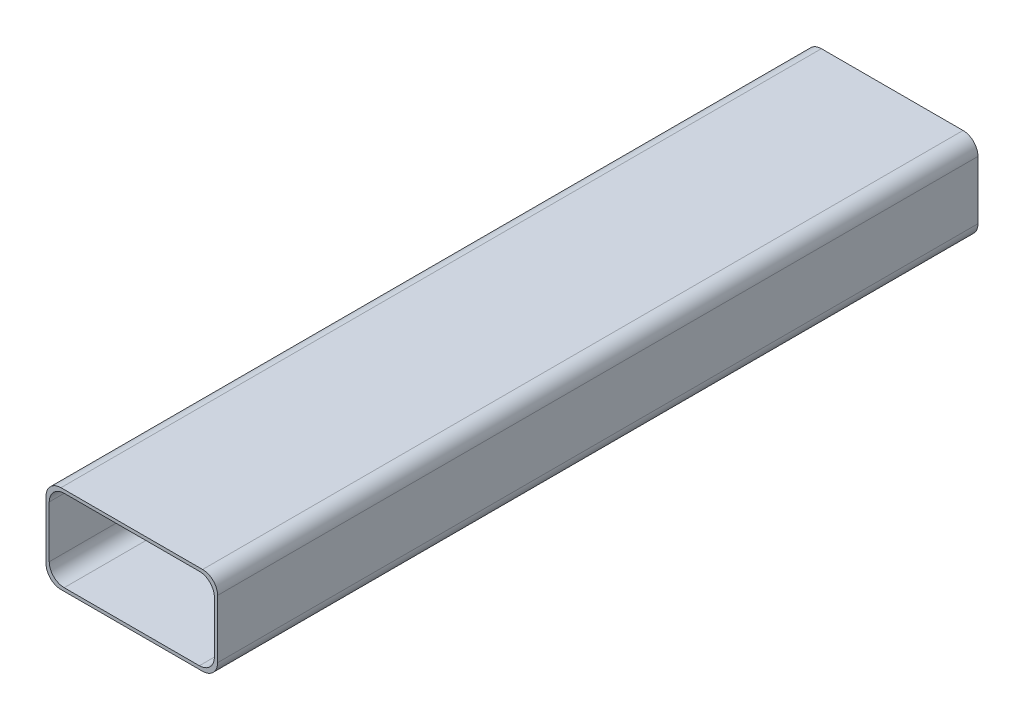
ISO-10303-21;
HEADER;
FILE_DESCRIPTION(('STEP AP214'),'2;1');
FILE_NAME('part.step','',(''),(''),'','','');
FILE_SCHEMA(('AUTOMOTIVE_DESIGN { 1 0 10303 214 1 1 1 1 }'));
ENDSEC;
DATA;
#1=APPLICATION_CONTEXT('core data for automotive mechanical design processes');
#2=APPLICATION_PROTOCOL_DEFINITION('international standard','automotive_design',2000,#1);
#3=PRODUCT_CONTEXT('',#1,'mechanical');
#4=PRODUCT('Part','Part','',(#3));
#5=PRODUCT_RELATED_PRODUCT_CATEGORY('part','',(#4));
#6=PRODUCT_DEFINITION_FORMATION('','',#4);
#7=PRODUCT_DEFINITION_CONTEXT('part definition',#1,'design');
#8=PRODUCT_DEFINITION('design','',#6,#7);
#9=PRODUCT_DEFINITION_SHAPE('','',#8);
#10=(LENGTH_UNIT() NAMED_UNIT(*) SI_UNIT(.MILLI.,.METRE.));
#11=(NAMED_UNIT(*) PLANE_ANGLE_UNIT() SI_UNIT($,.RADIAN.));
#12=(NAMED_UNIT(*) SI_UNIT($,.STERADIAN.) SOLID_ANGLE_UNIT());
#13=UNCERTAINTY_MEASURE_WITH_UNIT(LENGTH_MEASURE(1.E-05),#10,'distance_accuracy_value','');
#14=(GEOMETRIC_REPRESENTATION_CONTEXT(3) GLOBAL_UNCERTAINTY_ASSIGNED_CONTEXT((#13)) GLOBAL_UNIT_ASSIGNED_CONTEXT((#10,
#11,#12)) REPRESENTATION_CONTEXT('',''));
#15=CARTESIAN_POINT('',(0.,0.,0.));
#16=DIRECTION('',(0.,0.,1.));
#17=DIRECTION('',(1.,0.,0.));
#18=AXIS2_PLACEMENT_3D('',#15,#16,#17);
#19=CARTESIAN_POINT('',(47.3151,-19.464,508.));
#20=DIRECTION('',(0.,0.,1.));
#21=DIRECTION('',(1.,0.,0.));
#22=AXIS2_PLACEMENT_3D('',#19,#20,#21);
#23=PLANE('',#22);
#24=CARTESIAN_POINT('',(47.3151,-19.464,508.));
#25=DIRECTION('',(0.,0.,1.));
#26=DIRECTION('',(1.,0.,0.));
#27=AXIS2_PLACEMENT_3D('',#24,#25,#26);
#28=CIRCLE('',#27,10.);
#29=CARTESIAN_POINT('',(47.3150999999999,-29.464,508.));
#30=VERTEX_POINT('',#29);
#31=CARTESIAN_POINT('',(57.3151,-19.4639999999999,508.));
#32=VERTEX_POINT('',#31);
#33=EDGE_CURVE('E211',#30,#32,#28,.T.);
#34=ORIENTED_EDGE('',*,*,#33,.T.);
#35=DIRECTION('',(0.,1.,0.));
#36=VECTOR('',#35,1.);
#37=CARTESIAN_POINT('',(57.3151,-19.4639999999999,508.));
#38=LINE('',#37,#36);
#39=CARTESIAN_POINT('',(57.3151,19.4639999999999,508.));
#40=VERTEX_POINT('',#39);
#41=EDGE_CURVE('E214',#32,#40,#38,.T.);
#42=ORIENTED_EDGE('',*,*,#41,.T.);
#43=CARTESIAN_POINT('',(47.3151,19.464,508.));
#44=DIRECTION('',(0.,0.,1.));
#45=DIRECTION('',(-1.,0.,0.));
#46=AXIS2_PLACEMENT_3D('',#43,#44,#45);
#47=CIRCLE('',#46,10.);
#48=CARTESIAN_POINT('',(47.3150999999999,29.464,508.));
#49=VERTEX_POINT('',#48);
#50=EDGE_CURVE('E217',#40,#49,#47,.T.);
#51=ORIENTED_EDGE('',*,*,#50,.T.);
#52=DIRECTION('',(-1.,0.,0.));
#53=VECTOR('',#52,1.);
#54=CARTESIAN_POINT('',(-47.3150999999999,29.464,508.));
#55=LINE('',#54,#53);
#56=CARTESIAN_POINT('',(-47.3150999999999,29.464,508.));
#57=VERTEX_POINT('',#56);
#58=EDGE_CURVE('E219',#49,#57,#55,.T.);
#59=ORIENTED_EDGE('',*,*,#58,.T.);
#60=CARTESIAN_POINT('',(-47.3151,19.464,508.));
#61=DIRECTION('',(0.,0.,1.));
#62=DIRECTION('',(-1.,0.,0.));
#63=AXIS2_PLACEMENT_3D('',#60,#61,#62);
#64=CIRCLE('',#63,10.);
#65=CARTESIAN_POINT('',(-57.3151,19.4639999999999,508.));
#66=VERTEX_POINT('',#65);
#67=EDGE_CURVE('E221',#57,#66,#64,.T.);
#68=ORIENTED_EDGE('',*,*,#67,.T.);
#69=DIRECTION('',(0.,-1.,0.));
#70=VECTOR('',#69,1.);
#71=CARTESIAN_POINT('',(-57.3151,-19.4639999999999,508.));
#72=LINE('',#71,#70);
#73=CARTESIAN_POINT('',(-57.3151,-19.464,508.));
#74=VERTEX_POINT('',#73);
#75=EDGE_CURVE('E223',#66,#74,#72,.T.);
#76=ORIENTED_EDGE('',*,*,#75,.T.);
#77=CARTESIAN_POINT('',(-47.3151,-19.464,508.));
#78=DIRECTION('',(0.,0.,1.));
#79=DIRECTION('',(-1.,0.,0.));
#80=AXIS2_PLACEMENT_3D('',#77,#78,#79);
#81=CIRCLE('',#80,10.);
#82=CARTESIAN_POINT('',(-47.3150999999999,-29.464,508.));
#83=VERTEX_POINT('',#82);
#84=EDGE_CURVE('E225',#74,#83,#81,.T.);
#85=ORIENTED_EDGE('',*,*,#84,.T.);
#86=DIRECTION('',(1.,0.,0.));
#87=VECTOR('',#86,1.);
#88=CARTESIAN_POINT('',(-47.3150999999999,-29.464,508.));
#89=LINE('',#88,#87);
#90=EDGE_CURVE('E227',#83,#30,#89,.T.);
#91=ORIENTED_EDGE('',*,*,#90,.T.);
#92=EDGE_LOOP('',(#34,#42,#51,#59,#68,#76,#85,#91));
#93=FACE_BOUND('',#92,.T.);
#94=DIRECTION('',(0.,1.,0.));
#95=VECTOR('',#94,1.);
#96=CARTESIAN_POINT('',(55.1561,-17.3049999999999,508.));
#97=LINE('',#96,#95);
#98=CARTESIAN_POINT('',(55.1561,-17.3049999999999,508.));
#99=VERTEX_POINT('',#98);
#100=CARTESIAN_POINT('',(55.1561,17.3049999999999,508.));
#101=VERTEX_POINT('',#100);
#102=EDGE_CURVE('E154',#99,#101,#97,.T.);
#103=ORIENTED_EDGE('',*,*,#102,.F.);
#104=CARTESIAN_POINT('',(45.1561,-17.305,508.));
#105=DIRECTION('',(0.,0.,1.));
#106=DIRECTION('',(1.,0.,0.));
#107=AXIS2_PLACEMENT_3D('',#104,#105,#106);
#108=CIRCLE('',#107,10.);
#109=CARTESIAN_POINT('',(45.1560999999999,-27.305,508.));
#110=VERTEX_POINT('',#109);
#111=EDGE_CURVE('E146',#110,#99,#108,.T.);
#112=ORIENTED_EDGE('',*,*,#111,.F.);
#113=DIRECTION('',(1.,0.,0.));
#114=VECTOR('',#113,1.);
#115=CARTESIAN_POINT('',(-45.1560999999999,-27.305,508.));
#116=LINE('',#115,#114);
#117=CARTESIAN_POINT('',(-45.1560999999999,-27.305,508.));
#118=VERTEX_POINT('',#117);
#119=EDGE_CURVE('E179',#118,#110,#116,.T.);
#120=ORIENTED_EDGE('',*,*,#119,.F.);
#121=CARTESIAN_POINT('',(-45.1561,-17.305,508.));
#122=DIRECTION('',(0.,0.,1.));
#123=DIRECTION('',(-1.,0.,0.));
#124=AXIS2_PLACEMENT_3D('',#121,#122,#123);
#125=CIRCLE('',#124,10.);
#126=CARTESIAN_POINT('',(-55.1561,-17.305,508.));
#127=VERTEX_POINT('',#126);
#128=EDGE_CURVE('E177',#127,#118,#125,.T.);
#129=ORIENTED_EDGE('',*,*,#128,.F.);
#130=DIRECTION('',(0.,-1.,0.));
#131=VECTOR('',#130,1.);
#132=CARTESIAN_POINT('',(-55.1561,-17.3049999999999,508.));
#133=LINE('',#132,#131);
#134=CARTESIAN_POINT('',(-55.1561,17.3049999999999,508.));
#135=VERTEX_POINT('',#134);
#136=EDGE_CURVE('E175',#135,#127,#133,.T.);
#137=ORIENTED_EDGE('',*,*,#136,.F.);
#138=CARTESIAN_POINT('',(-45.1561,17.305,508.));
#139=DIRECTION('',(0.,0.,1.));
#140=DIRECTION('',(-1.,0.,0.));
#141=AXIS2_PLACEMENT_3D('',#138,#139,#140);
#142=CIRCLE('',#141,10.);
#143=CARTESIAN_POINT('',(-45.1560999999999,27.305,508.));
#144=VERTEX_POINT('',#143);
#145=EDGE_CURVE('E173',#144,#135,#142,.T.);
#146=ORIENTED_EDGE('',*,*,#145,.F.);
#147=DIRECTION('',(-1.,0.,0.));
#148=VECTOR('',#147,1.);
#149=CARTESIAN_POINT('',(-45.1560999999999,27.305,508.));
#150=LINE('',#149,#148);
#151=CARTESIAN_POINT('',(45.1560999999999,27.305,508.));
#152=VERTEX_POINT('',#151);
#153=EDGE_CURVE('E169',#152,#144,#150,.T.);
#154=ORIENTED_EDGE('',*,*,#153,.F.);
#155=CARTESIAN_POINT('',(45.1561,17.305,508.));
#156=DIRECTION('',(0.,0.,1.));
#157=DIRECTION('',(-1.,0.,0.));
#158=AXIS2_PLACEMENT_3D('',#155,#156,#157);
#159=CIRCLE('',#158,10.);
#160=EDGE_CURVE('E167',#101,#152,#159,.T.);
#161=ORIENTED_EDGE('',*,*,#160,.F.);
#162=EDGE_LOOP('',(#103,#112,#120,#129,#137,#146,#154,#161));
#163=FACE_BOUND('',#162,.T.);
#164=ADVANCED_FACE('F33',(#93,#163),#23,.T.);
#165=CARTESIAN_POINT('',(47.3151,-19.464,0.));
#166=DIRECTION('',(0.,0.,1.));
#167=DIRECTION('',(1.,0.,0.));
#168=AXIS2_PLACEMENT_3D('',#165,#166,#167);
#169=PLANE('',#168);
#170=CARTESIAN_POINT('',(47.3151,-19.464,0.));
#171=DIRECTION('',(0.,0.,1.));
#172=DIRECTION('',(1.,0.,0.));
#173=AXIS2_PLACEMENT_3D('',#170,#171,#172);
#174=CIRCLE('',#173,10.);
#175=CARTESIAN_POINT('',(47.3150999999999,-29.464,0.));
#176=VERTEX_POINT('',#175);
#177=CARTESIAN_POINT('',(57.3151,-19.4639999999999,0.));
#178=VERTEX_POINT('',#177);
#179=EDGE_CURVE('E162',#176,#178,#174,.T.);
#180=ORIENTED_EDGE('',*,*,#179,.F.);
#181=DIRECTION('',(1.,0.,0.));
#182=VECTOR('',#181,1.);
#183=CARTESIAN_POINT('',(-47.3150999999999,-29.464,0.));
#184=LINE('',#183,#182);
#185=CARTESIAN_POINT('',(-47.3150999999999,-29.464,0.));
#186=VERTEX_POINT('',#185);
#187=EDGE_CURVE('E215',#186,#176,#184,.T.);
#188=ORIENTED_EDGE('',*,*,#187,.F.);
#189=CARTESIAN_POINT('',(-47.3151,-19.464,0.));
#190=DIRECTION('',(0.,0.,1.));
#191=DIRECTION('',(-1.,0.,0.));
#192=AXIS2_PLACEMENT_3D('',#189,#190,#191);
#193=CIRCLE('',#192,10.);
#194=CARTESIAN_POINT('',(-57.3151,-19.464,0.));
#195=VERTEX_POINT('',#194);
#196=EDGE_CURVE('E242',#195,#186,#193,.T.);
#197=ORIENTED_EDGE('',*,*,#196,.F.);
#198=DIRECTION('',(0.,-1.,0.));
#199=VECTOR('',#198,1.);
#200=CARTESIAN_POINT('',(-57.3151,-19.4639999999999,0.));
#201=LINE('',#200,#199);
#202=CARTESIAN_POINT('',(-57.3151,19.4639999999999,0.));
#203=VERTEX_POINT('',#202);
#204=EDGE_CURVE('E240',#203,#195,#201,.T.);
#205=ORIENTED_EDGE('',*,*,#204,.F.);
#206=CARTESIAN_POINT('',(-47.3151,19.464,0.));
#207=DIRECTION('',(0.,0.,1.));
#208=DIRECTION('',(-1.,0.,0.));
#209=AXIS2_PLACEMENT_3D('',#206,#207,#208);
#210=CIRCLE('',#209,10.);
#211=CARTESIAN_POINT('',(-47.3150999999999,29.464,0.));
#212=VERTEX_POINT('',#211);
#213=EDGE_CURVE('E238',#212,#203,#210,.T.);
#214=ORIENTED_EDGE('',*,*,#213,.F.);
#215=DIRECTION('',(-1.,0.,0.));
#216=VECTOR('',#215,1.);
#217=CARTESIAN_POINT('',(-47.3150999999999,29.464,0.));
#218=LINE('',#217,#216);
#219=CARTESIAN_POINT('',(47.3150999999999,29.464,0.));
#220=VERTEX_POINT('',#219);
#221=EDGE_CURVE('E236',#220,#212,#218,.T.);
#222=ORIENTED_EDGE('',*,*,#221,.F.);
#223=CARTESIAN_POINT('',(47.3151,19.464,0.));
#224=DIRECTION('',(0.,0.,1.));
#225=DIRECTION('',(-1.,0.,0.));
#226=AXIS2_PLACEMENT_3D('',#223,#224,#225);
#227=CIRCLE('',#226,10.);
#228=CARTESIAN_POINT('',(57.3151,19.4639999999999,0.));
#229=VERTEX_POINT('',#228);
#230=EDGE_CURVE('E234',#229,#220,#227,.T.);
#231=ORIENTED_EDGE('',*,*,#230,.F.);
#232=DIRECTION('',(0.,1.,0.));
#233=VECTOR('',#232,1.);
#234=CARTESIAN_POINT('',(57.3151,-19.4639999999999,0.));
#235=LINE('',#234,#233);
#236=EDGE_CURVE('E232',#178,#229,#235,.T.);
#237=ORIENTED_EDGE('',*,*,#236,.F.);
#238=EDGE_LOOP('',(#180,#188,#197,#205,#214,#222,#231,#237));
#239=FACE_BOUND('',#238,.T.);
#240=CARTESIAN_POINT('',(45.1561,-17.305,0.));
#241=DIRECTION('',(0.,0.,1.));
#242=DIRECTION('',(1.,0.,0.));
#243=AXIS2_PLACEMENT_3D('',#240,#241,#242);
#244=CIRCLE('',#243,10.);
#245=CARTESIAN_POINT('',(45.1560999999999,-27.305,0.));
#246=VERTEX_POINT('',#245);
#247=CARTESIAN_POINT('',(55.1561,-17.3049999999999,0.));
#248=VERTEX_POINT('',#247);
#249=EDGE_CURVE('E56',#246,#248,#244,.T.);
#250=ORIENTED_EDGE('',*,*,#249,.T.);
#251=DIRECTION('',(0.,1.,0.));
#252=VECTOR('',#251,1.);
#253=CARTESIAN_POINT('',(55.1561,-17.3049999999999,0.));
#254=LINE('',#253,#252);
#255=CARTESIAN_POINT('',(55.1561,17.3049999999999,0.));
#256=VERTEX_POINT('',#255);
#257=EDGE_CURVE('E161',#248,#256,#254,.T.);
#258=ORIENTED_EDGE('',*,*,#257,.T.);
#259=CARTESIAN_POINT('',(45.1561,17.305,0.));
#260=DIRECTION('',(0.,0.,1.));
#261=DIRECTION('',(-1.,0.,0.));
#262=AXIS2_PLACEMENT_3D('',#259,#260,#261);
#263=CIRCLE('',#262,10.);
#264=CARTESIAN_POINT('',(45.1560999999999,27.305,0.));
#265=VERTEX_POINT('',#264);
#266=EDGE_CURVE('E183',#256,#265,#263,.T.);
#267=ORIENTED_EDGE('',*,*,#266,.T.);
#268=DIRECTION('',(-1.,0.,0.));
#269=VECTOR('',#268,1.);
#270=CARTESIAN_POINT('',(-45.1560999999999,27.305,0.));
#271=LINE('',#270,#269);
#272=CARTESIAN_POINT('',(-45.1560999999999,27.305,0.));
#273=VERTEX_POINT('',#272);
#274=EDGE_CURVE('E186',#265,#273,#271,.T.);
#275=ORIENTED_EDGE('',*,*,#274,.T.);
#276=CARTESIAN_POINT('',(-45.1561,17.305,0.));
#277=DIRECTION('',(0.,0.,1.));
#278=DIRECTION('',(-1.,0.,0.));
#279=AXIS2_PLACEMENT_3D('',#276,#277,#278);
#280=CIRCLE('',#279,10.);
#281=CARTESIAN_POINT('',(-55.1561,17.3049999999999,0.));
#282=VERTEX_POINT('',#281);
#283=EDGE_CURVE('E189',#273,#282,#280,.T.);
#284=ORIENTED_EDGE('',*,*,#283,.T.);
#285=DIRECTION('',(0.,-1.,0.));
#286=VECTOR('',#285,1.);
#287=CARTESIAN_POINT('',(-55.1561,-17.3049999999999,0.));
#288=LINE('',#287,#286);
#289=CARTESIAN_POINT('',(-55.1561,-17.305,0.));
#290=VERTEX_POINT('',#289);
#291=EDGE_CURVE('E192',#282,#290,#288,.T.);
#292=ORIENTED_EDGE('',*,*,#291,.T.);
#293=CARTESIAN_POINT('',(-45.1561,-17.305,0.));
#294=DIRECTION('',(0.,0.,1.));
#295=DIRECTION('',(-1.,0.,0.));
#296=AXIS2_PLACEMENT_3D('',#293,#294,#295);
#297=CIRCLE('',#296,10.);
#298=CARTESIAN_POINT('',(-45.1560999999999,-27.305,0.));
#299=VERTEX_POINT('',#298);
#300=EDGE_CURVE('E195',#290,#299,#297,.T.);
#301=ORIENTED_EDGE('',*,*,#300,.T.);
#302=DIRECTION('',(1.,0.,0.));
#303=VECTOR('',#302,1.);
#304=CARTESIAN_POINT('',(-45.1560999999999,-27.305,0.));
#305=LINE('',#304,#303);
#306=EDGE_CURVE('E155',#299,#246,#305,.T.);
#307=ORIENTED_EDGE('',*,*,#306,.T.);
#308=EDGE_LOOP('',(#250,#258,#267,#275,#284,#292,#301,#307));
#309=FACE_BOUND('',#308,.T.);
#310=ADVANCED_FACE('F272',(#239,#309),#169,.F.);
#311=CARTESIAN_POINT('',(47.3151,-19.464,508.));
#312=DIRECTION('',(0.,0.,-1.));
#313=DIRECTION('',(-1.,0.,0.));
#314=AXIS2_PLACEMENT_3D('',#311,#312,#313);
#315=CYLINDRICAL_SURFACE('',#314,10.);
#316=ORIENTED_EDGE('',*,*,#179,.T.);
#317=DIRECTION('',(0.,0.,-1.));
#318=VECTOR('',#317,1.);
#319=CARTESIAN_POINT('',(57.3151,-19.4639999999999,508.));
#320=LINE('',#319,#318);
#321=EDGE_CURVE('E11',#32,#178,#320,.T.);
#322=ORIENTED_EDGE('',*,*,#321,.F.);
#323=ORIENTED_EDGE('',*,*,#33,.F.);
#324=DIRECTION('',(0.,0.,-1.));
#325=VECTOR('',#324,1.);
#326=CARTESIAN_POINT('',(47.3150999999999,-29.464,508.));
#327=LINE('',#326,#325);
#328=EDGE_CURVE('E229',#30,#176,#327,.T.);
#329=ORIENTED_EDGE('',*,*,#328,.T.);
#330=EDGE_LOOP('',(#316,#322,#323,#329));
#331=FACE_BOUND('',#330,.T.);
#332=ADVANCED_FACE('F35',(#331),#315,.T.);
#333=CARTESIAN_POINT('',(57.3151,-19.4639999999999,508.));
#334=DIRECTION('',(-1.,0.,0.));
#335=DIRECTION('',(0.,0.,1.));
#336=AXIS2_PLACEMENT_3D('',#333,#334,#335);
#337=PLANE('',#336);
#338=ORIENTED_EDGE('',*,*,#236,.T.);
#339=DIRECTION('',(0.,0.,-1.));
#340=VECTOR('',#339,1.);
#341=CARTESIAN_POINT('',(57.3151,19.4639999999999,508.));
#342=LINE('',#341,#340);
#343=EDGE_CURVE('E41',#40,#229,#342,.T.);
#344=ORIENTED_EDGE('',*,*,#343,.F.);
#345=ORIENTED_EDGE('',*,*,#41,.F.);
#346=ORIENTED_EDGE('',*,*,#321,.T.);
#347=EDGE_LOOP('',(#338,#344,#345,#346));
#348=FACE_BOUND('',#347,.T.);
#349=ADVANCED_FACE('F289',(#348),#337,.F.);
#350=CARTESIAN_POINT('',(47.3151,19.464,508.));
#351=DIRECTION('',(0.,0.,-1.));
#352=DIRECTION('',(-1.,0.,0.));
#353=AXIS2_PLACEMENT_3D('',#350,#351,#352);
#354=CYLINDRICAL_SURFACE('',#353,10.);
#355=ORIENTED_EDGE('',*,*,#230,.T.);
#356=DIRECTION('',(0.,0.,-1.));
#357=VECTOR('',#356,1.);
#358=CARTESIAN_POINT('',(47.3150999999999,29.464,508.));
#359=LINE('',#358,#357);
#360=EDGE_CURVE('E259',#49,#220,#359,.T.);
#361=ORIENTED_EDGE('',*,*,#360,.F.);
#362=ORIENTED_EDGE('',*,*,#50,.F.);
#363=ORIENTED_EDGE('',*,*,#343,.T.);
#364=EDGE_LOOP('',(#355,#361,#362,#363));
#365=FACE_BOUND('',#364,.T.);
#366=ADVANCED_FACE('F266',(#365),#354,.T.);
#367=CARTESIAN_POINT('',(-47.3150999999999,29.464,508.));
#368=DIRECTION('',(0.,-1.,0.));
#369=DIRECTION('',(0.,0.,-1.));
#370=AXIS2_PLACEMENT_3D('',#367,#368,#369);
#371=PLANE('',#370);
#372=ORIENTED_EDGE('',*,*,#221,.T.);
#373=DIRECTION('',(0.,0.,-1.));
#374=VECTOR('',#373,1.);
#375=CARTESIAN_POINT('',(-47.3150999999999,29.464,508.));
#376=LINE('',#375,#374);
#377=EDGE_CURVE('E256',#57,#212,#376,.T.);
#378=ORIENTED_EDGE('',*,*,#377,.F.);
#379=ORIENTED_EDGE('',*,*,#58,.F.);
#380=ORIENTED_EDGE('',*,*,#360,.T.);
#381=EDGE_LOOP('',(#372,#378,#379,#380));
#382=FACE_BOUND('',#381,.T.);
#383=ADVANCED_FACE('F278',(#382),#371,.F.);
#384=CARTESIAN_POINT('',(-47.3151,19.464,508.));
#385=DIRECTION('',(0.,0.,-1.));
#386=DIRECTION('',(-1.,0.,0.));
#387=AXIS2_PLACEMENT_3D('',#384,#385,#386);
#388=CYLINDRICAL_SURFACE('',#387,10.);
#389=ORIENTED_EDGE('',*,*,#213,.T.);
#390=DIRECTION('',(0.,0.,-1.));
#391=VECTOR('',#390,1.);
#392=CARTESIAN_POINT('',(-57.3151,19.4639999999999,508.));
#393=LINE('',#392,#391);
#394=EDGE_CURVE('E253',#66,#203,#393,.T.);
#395=ORIENTED_EDGE('',*,*,#394,.F.);
#396=ORIENTED_EDGE('',*,*,#67,.F.);
#397=ORIENTED_EDGE('',*,*,#377,.T.);
#398=EDGE_LOOP('',(#389,#395,#396,#397));
#399=FACE_BOUND('',#398,.T.);
#400=ADVANCED_FACE('F282',(#399),#388,.T.);
#401=CARTESIAN_POINT('',(-57.3151,-19.4639999999999,508.));
#402=DIRECTION('',(1.,0.,0.));
#403=DIRECTION('',(0.,0.,-1.));
#404=AXIS2_PLACEMENT_3D('',#401,#402,#403);
#405=PLANE('',#404);
#406=ORIENTED_EDGE('',*,*,#204,.T.);
#407=DIRECTION('',(0.,0.,-1.));
#408=VECTOR('',#407,1.);
#409=CARTESIAN_POINT('',(-57.3151,-19.464,508.));
#410=LINE('',#409,#408);
#411=EDGE_CURVE('E250',#74,#195,#410,.T.);
#412=ORIENTED_EDGE('',*,*,#411,.F.);
#413=ORIENTED_EDGE('',*,*,#75,.F.);
#414=ORIENTED_EDGE('',*,*,#394,.T.);
#415=EDGE_LOOP('',(#406,#412,#413,#414));
#416=FACE_BOUND('',#415,.T.);
#417=ADVANCED_FACE('F302',(#416),#405,.F.);
#418=CARTESIAN_POINT('',(-47.3151,-19.464,508.));
#419=DIRECTION('',(0.,0.,-1.));
#420=DIRECTION('',(-1.,0.,0.));
#421=AXIS2_PLACEMENT_3D('',#418,#419,#420);
#422=CYLINDRICAL_SURFACE('',#421,10.);
#423=ORIENTED_EDGE('',*,*,#196,.T.);
#424=DIRECTION('',(0.,0.,-1.));
#425=VECTOR('',#424,1.);
#426=CARTESIAN_POINT('',(-47.3150999999999,-29.464,508.));
#427=LINE('',#426,#425);
#428=EDGE_CURVE('E247',#83,#186,#427,.T.);
#429=ORIENTED_EDGE('',*,*,#428,.F.);
#430=ORIENTED_EDGE('',*,*,#84,.F.);
#431=ORIENTED_EDGE('',*,*,#411,.T.);
#432=EDGE_LOOP('',(#423,#429,#430,#431));
#433=FACE_BOUND('',#432,.T.);
#434=ADVANCED_FACE('F300',(#433),#422,.T.);
#435=CARTESIAN_POINT('',(-47.3150999999999,-29.464,508.));
#436=DIRECTION('',(0.,1.,0.));
#437=DIRECTION('',(0.,0.,1.));
#438=AXIS2_PLACEMENT_3D('',#435,#436,#437);
#439=PLANE('',#438);
#440=ORIENTED_EDGE('',*,*,#187,.T.);
#441=ORIENTED_EDGE('',*,*,#328,.F.);
#442=ORIENTED_EDGE('',*,*,#90,.F.);
#443=ORIENTED_EDGE('',*,*,#428,.T.);
#444=EDGE_LOOP('',(#440,#441,#442,#443));
#445=FACE_BOUND('',#444,.T.);
#446=ADVANCED_FACE('F295',(#445),#439,.F.);
#447=CARTESIAN_POINT('',(45.1561,-17.305,508.));
#448=DIRECTION('',(0.,0.,-1.));
#449=DIRECTION('',(-1.,0.,0.));
#450=AXIS2_PLACEMENT_3D('',#447,#448,#449);
#451=CYLINDRICAL_SURFACE('',#450,10.);
#452=ORIENTED_EDGE('',*,*,#249,.F.);
#453=DIRECTION('',(0.,0.,-1.));
#454=VECTOR('',#453,1.);
#455=CARTESIAN_POINT('',(45.1560999999999,-27.305,508.));
#456=LINE('',#455,#454);
#457=EDGE_CURVE('E150',#110,#246,#456,.T.);
#458=ORIENTED_EDGE('',*,*,#457,.F.);
#459=ORIENTED_EDGE('',*,*,#111,.T.);
#460=DIRECTION('',(0.,0.,-1.));
#461=VECTOR('',#460,1.);
#462=CARTESIAN_POINT('',(55.1561,-17.3049999999999,508.));
#463=LINE('',#462,#461);
#464=EDGE_CURVE('E149',#99,#248,#463,.T.);
#465=ORIENTED_EDGE('',*,*,#464,.T.);
#466=EDGE_LOOP('',(#452,#458,#459,#465));
#467=FACE_BOUND('',#466,.T.);
#468=ADVANCED_FACE('F148',(#467),#451,.F.);
#469=CARTESIAN_POINT('',(55.1561,-17.3049999999999,508.));
#470=DIRECTION('',(-1.,0.,0.));
#471=DIRECTION('',(0.,0.,1.));
#472=AXIS2_PLACEMENT_3D('',#469,#470,#471);
#473=PLANE('',#472);
#474=ORIENTED_EDGE('',*,*,#257,.F.);
#475=ORIENTED_EDGE('',*,*,#464,.F.);
#476=ORIENTED_EDGE('',*,*,#102,.T.);
#477=DIRECTION('',(0.,0.,-1.));
#478=VECTOR('',#477,1.);
#479=CARTESIAN_POINT('',(55.1561,17.3049999999999,508.));
#480=LINE('',#479,#478);
#481=EDGE_CURVE('E163',#101,#256,#480,.T.);
#482=ORIENTED_EDGE('',*,*,#481,.T.);
#483=EDGE_LOOP('',(#474,#475,#476,#482));
#484=FACE_BOUND('',#483,.T.);
#485=ADVANCED_FACE('F158',(#484),#473,.T.);
#486=CARTESIAN_POINT('',(45.1561,17.305,508.));
#487=DIRECTION('',(0.,0.,-1.));
#488=DIRECTION('',(-1.,0.,0.));
#489=AXIS2_PLACEMENT_3D('',#486,#487,#488);
#490=CYLINDRICAL_SURFACE('',#489,10.);
#491=ORIENTED_EDGE('',*,*,#266,.F.);
#492=ORIENTED_EDGE('',*,*,#481,.F.);
#493=ORIENTED_EDGE('',*,*,#160,.T.);
#494=DIRECTION('',(0.,0.,-1.));
#495=VECTOR('',#494,1.);
#496=CARTESIAN_POINT('',(45.1560999999999,27.305,508.));
#497=LINE('',#496,#495);
#498=EDGE_CURVE('E208',#152,#265,#497,.T.);
#499=ORIENTED_EDGE('',*,*,#498,.T.);
#500=EDGE_LOOP('',(#491,#492,#493,#499));
#501=FACE_BOUND('',#500,.T.);
#502=ADVANCED_FACE('F327',(#501),#490,.F.);
#503=CARTESIAN_POINT('',(-45.1560999999999,27.305,508.));
#504=DIRECTION('',(0.,-1.,0.));
#505=DIRECTION('',(0.,0.,-1.));
#506=AXIS2_PLACEMENT_3D('',#503,#504,#505);
#507=PLANE('',#506);
#508=ORIENTED_EDGE('',*,*,#274,.F.);
#509=ORIENTED_EDGE('',*,*,#498,.F.);
#510=ORIENTED_EDGE('',*,*,#153,.T.);
#511=DIRECTION('',(0.,0.,-1.));
#512=VECTOR('',#511,1.);
#513=CARTESIAN_POINT('',(-45.1560999999999,27.305,508.));
#514=LINE('',#513,#512);
#515=EDGE_CURVE('E206',#144,#273,#514,.T.);
#516=ORIENTED_EDGE('',*,*,#515,.T.);
#517=EDGE_LOOP('',(#508,#509,#510,#516));
#518=FACE_BOUND('',#517,.T.);
#519=ADVANCED_FACE('F331',(#518),#507,.T.);
#520=CARTESIAN_POINT('',(-45.1561,17.305,508.));
#521=DIRECTION('',(0.,0.,-1.));
#522=DIRECTION('',(-1.,0.,0.));
#523=AXIS2_PLACEMENT_3D('',#520,#521,#522);
#524=CYLINDRICAL_SURFACE('',#523,10.);
#525=ORIENTED_EDGE('',*,*,#283,.F.);
#526=ORIENTED_EDGE('',*,*,#515,.F.);
#527=ORIENTED_EDGE('',*,*,#145,.T.);
#528=DIRECTION('',(0.,0.,-1.));
#529=VECTOR('',#528,1.);
#530=CARTESIAN_POINT('',(-55.1561,17.3049999999999,508.));
#531=LINE('',#530,#529);
#532=EDGE_CURVE('E204',#135,#282,#531,.T.);
#533=ORIENTED_EDGE('',*,*,#532,.T.);
#534=EDGE_LOOP('',(#525,#526,#527,#533));
#535=FACE_BOUND('',#534,.T.);
#536=ADVANCED_FACE('F337',(#535),#524,.F.);
#537=CARTESIAN_POINT('',(-55.1561,-17.3049999999999,508.));
#538=DIRECTION('',(1.,0.,0.));
#539=DIRECTION('',(0.,0.,-1.));
#540=AXIS2_PLACEMENT_3D('',#537,#538,#539);
#541=PLANE('',#540);
#542=ORIENTED_EDGE('',*,*,#291,.F.);
#543=ORIENTED_EDGE('',*,*,#532,.F.);
#544=ORIENTED_EDGE('',*,*,#136,.T.);
#545=DIRECTION('',(0.,0.,-1.));
#546=VECTOR('',#545,1.);
#547=CARTESIAN_POINT('',(-55.1561,-17.305,508.));
#548=LINE('',#547,#546);
#549=EDGE_CURVE('E202',#127,#290,#548,.T.);
#550=ORIENTED_EDGE('',*,*,#549,.T.);
#551=EDGE_LOOP('',(#542,#543,#544,#550));
#552=FACE_BOUND('',#551,.T.);
#553=ADVANCED_FACE('F341',(#552),#541,.T.);
#554=CARTESIAN_POINT('',(-45.1561,-17.305,508.));
#555=DIRECTION('',(0.,0.,-1.));
#556=DIRECTION('',(-1.,0.,0.));
#557=AXIS2_PLACEMENT_3D('',#554,#555,#556);
#558=CYLINDRICAL_SURFACE('',#557,10.);
#559=ORIENTED_EDGE('',*,*,#300,.F.);
#560=ORIENTED_EDGE('',*,*,#549,.F.);
#561=ORIENTED_EDGE('',*,*,#128,.T.);
#562=DIRECTION('',(0.,0.,-1.));
#563=VECTOR('',#562,1.);
#564=CARTESIAN_POINT('',(-45.1560999999999,-27.305,508.));
#565=LINE('',#564,#563);
#566=EDGE_CURVE('E48',#118,#299,#565,.T.);
#567=ORIENTED_EDGE('',*,*,#566,.T.);
#568=EDGE_LOOP('',(#559,#560,#561,#567));
#569=FACE_BOUND('',#568,.T.);
#570=ADVANCED_FACE('F345',(#569),#558,.F.);
#571=CARTESIAN_POINT('',(-45.1560999999999,-27.305,508.));
#572=DIRECTION('',(0.,1.,0.));
#573=DIRECTION('',(0.,0.,1.));
#574=AXIS2_PLACEMENT_3D('',#571,#572,#573);
#575=PLANE('',#574);
#576=ORIENTED_EDGE('',*,*,#306,.F.);
#577=ORIENTED_EDGE('',*,*,#566,.F.);
#578=ORIENTED_EDGE('',*,*,#119,.T.);
#579=ORIENTED_EDGE('',*,*,#457,.T.);
#580=EDGE_LOOP('',(#576,#577,#578,#579));
#581=FACE_BOUND('',#580,.T.);
#582=ADVANCED_FACE('F349',(#581),#575,.T.);
#583=CLOSED_SHELL('',(#164,#310,#332,#349,#366,#383,#400,#417,#434,#446,#468,#485,#502,#519,
#536,#553,#570,#582));
#584=MANIFOLD_SOLID_BREP('B2',#583);
#585=ADVANCED_BREP_SHAPE_REPRESENTATION('',(#18,#584),#14);
#586=SHAPE_DEFINITION_REPRESENTATION(#9,#585);
ENDSEC;
END-ISO-10303-21;
